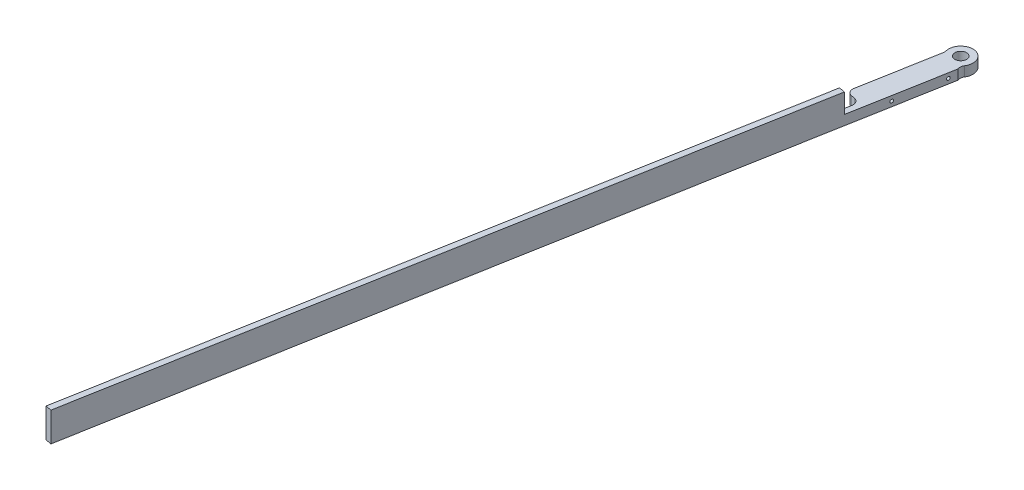
ISO-10303-21;
HEADER;
FILE_DESCRIPTION(('STEP AP214'),'2;1');
FILE_NAME('part.step','',(''),(''),'','','');
FILE_SCHEMA(('AUTOMOTIVE_DESIGN { 1 0 10303 214 1 1 1 1 }'));
ENDSEC;
DATA;
#1=APPLICATION_CONTEXT('core data for automotive mechanical design processes');
#2=APPLICATION_PROTOCOL_DEFINITION('international standard','automotive_design',2000,#1);
#3=PRODUCT_CONTEXT('',#1,'mechanical');
#4=PRODUCT('Part','Part','',(#3));
#5=PRODUCT_RELATED_PRODUCT_CATEGORY('part','',(#4));
#6=PRODUCT_DEFINITION_FORMATION('','',#4);
#7=PRODUCT_DEFINITION_CONTEXT('part definition',#1,'design');
#8=PRODUCT_DEFINITION('design','',#6,#7);
#9=PRODUCT_DEFINITION_SHAPE('','',#8);
#10=(LENGTH_UNIT() NAMED_UNIT(*) SI_UNIT(.MILLI.,.METRE.));
#11=(NAMED_UNIT(*) PLANE_ANGLE_UNIT() SI_UNIT($,.RADIAN.));
#12=(NAMED_UNIT(*) SI_UNIT($,.STERADIAN.) SOLID_ANGLE_UNIT());
#13=UNCERTAINTY_MEASURE_WITH_UNIT(LENGTH_MEASURE(1.E-05),#10,'distance_accuracy_value','');
#14=(GEOMETRIC_REPRESENTATION_CONTEXT(3) GLOBAL_UNCERTAINTY_ASSIGNED_CONTEXT((#13)) GLOBAL_UNIT_ASSIGNED_CONTEXT((#10,
#11,#12)) REPRESENTATION_CONTEXT('',''));
#15=CARTESIAN_POINT('',(0.,0.,0.));
#16=DIRECTION('',(0.,0.,1.));
#17=DIRECTION('',(1.,0.,0.));
#18=AXIS2_PLACEMENT_3D('',#15,#16,#17);
#19=CARTESIAN_POINT('',(-49.5390464281149,13.3887843778313,304.115242751326));
#20=DIRECTION('',(-0.984133598231858,0.,-0.177429030407133));
#21=DIRECTION('',(-0.177429030407133,0.,0.984133598231858));
#22=AXIS2_PLACEMENT_3D('',#19,#20,#21);
#23=PLANE('',#22);
#24=CARTESIAN_POINT('',(-26.4422223948663,9.57878437783127,176.005651601494));
#25=DIRECTION('',(0.984133598231858,0.,0.177429030407133));
#26=DIRECTION('',(0.177429030407133,0.,-0.984133598231858));
#27=AXIS2_PLACEMENT_3D('',#24,#25,#26);
#28=CIRCLE('',#27,0.634999999999989);
#29=CARTESIAN_POINT('',(-26.3295549605578,9.57878437783127,175.380726766617));
#30=VERTEX_POINT('',#29);
#31=EDGE_CURVE('E197',#30,#30,#28,.T.);
#32=ORIENTED_EDGE('',*,*,#31,.T.);
#33=EDGE_LOOP('',(#32));
#34=FACE_BOUND('',#33,.T.);
#35=CARTESIAN_POINT('',(-26.4422223948661,9.57878437783127,176.005651601494));
#36=DIRECTION('',(0.984133598231858,0.,0.177429030407133));
#37=DIRECTION('',(-0.177429030407133,0.,0.984133598231858));
#38=AXIS2_PLACEMENT_3D('',#35,#36,#37);
#39=CIRCLE('',#38,1.27);
#40=CARTESIAN_POINT('',(-26.6675572634832,9.57878437783127,177.255501271248));
#41=VERTEX_POINT('',#40);
#42=EDGE_CURVE('E285',#41,#41,#39,.T.);
#43=ORIENTED_EDGE('',*,*,#42,.F.);
#44=EDGE_LOOP('',(#43));
#45=FACE_BOUND('',#44,.T.);
#46=ADVANCED_FACE('F44',(#34,#45),#23,.T.);
#47=CARTESIAN_POINT('',(-23.0621993656104,9.57878437783127,157.257906555177));
#48=DIRECTION('',(0.984133598231858,0.,0.177429030407133));
#49=DIRECTION('',(0.177429030407133,0.,-0.984133598231858));
#50=AXIS2_PLACEMENT_3D('',#47,#48,#49);
#51=CIRCLE('',#50,0.634999999999989);
#52=CARTESIAN_POINT('',(-22.9495319313019,9.57878437783127,156.6329817203));
#53=VERTEX_POINT('',#52);
#54=EDGE_CURVE('E160',#53,#53,#51,.T.);
#55=ORIENTED_EDGE('',*,*,#54,.T.);
#56=EDGE_LOOP('',(#55));
#57=FACE_BOUND('',#56,.T.);
#58=CARTESIAN_POINT('',(-23.0621993656102,9.57878437783127,157.257906555177));
#59=DIRECTION('',(0.984133598231858,0.,0.177429030407133));
#60=DIRECTION('',(-0.177429030407133,0.,0.984133598231858));
#61=AXIS2_PLACEMENT_3D('',#58,#59,#60);
#62=CIRCLE('',#61,1.27);
#63=CARTESIAN_POINT('',(-23.2875342342273,9.57878437783127,158.507756224931));
#64=VERTEX_POINT('',#63);
#65=EDGE_CURVE('E278',#64,#64,#62,.T.);
#66=ORIENTED_EDGE('',*,*,#65,.F.);
#67=EDGE_LOOP('',(#66));
#68=FACE_BOUND('',#67,.T.);
#69=ADVANCED_FACE('F325',(#57,#68),#23,.T.);
#70=CARTESIAN_POINT('',(-74.2357625313724,19.1037843778313,454.519706000519));
#71=DIRECTION('',(0.,-1.,0.));
#72=DIRECTION('',(-0.984133598231858,0.,-0.177429030407133));
#73=AXIS2_PLACEMENT_3D('',#70,#71,#72);
#74=PLANE('',#73);
#75=DIRECTION('',(-0.177429030407133,0.,0.984133598231858));
#76=VECTOR('',#75,1.);
#77=CARTESIAN_POINT('',(-74.2357625313724,19.1037843778313,454.519706000519));
#78=LINE('',#77,#76);
#79=CARTESIAN_POINT('',(-26.91544012179,19.1037843778313,192.051275352082));
#80=VERTEX_POINT('',#79);
#81=CARTESIAN_POINT('',(-74.2357625313724,19.1037843778313,454.519706000519));
#82=VERTEX_POINT('',#81);
#83=EDGE_CURVE('E208',#80,#82,#78,.T.);
#84=ORIENTED_EDGE('',*,*,#83,.F.);
#85=DIRECTION('',(0.984133598231858,0.,0.177429030407133));
#86=VECTOR('',#85,1.);
#87=CARTESIAN_POINT('',(-29.2589082525796,19.1037843778313,191.628772473425));
#88=LINE('',#87,#86);
#89=CARTESIAN_POINT('',(-29.2589082525796,19.1037843778313,191.628772473425));
#90=VERTEX_POINT('',#89);
#91=EDGE_CURVE('E179',#90,#80,#88,.T.);
#92=ORIENTED_EDGE('',*,*,#91,.F.);
#93=DIRECTION('',(-0.177429030407133,0.,0.984133598231858));
#94=VECTOR('',#93,1.);
#95=CARTESIAN_POINT('',(-76.579230662162,19.1037843778313,454.097203121862));
#96=LINE('',#95,#94);
#97=CARTESIAN_POINT('',(-76.579230662162,19.1037843778313,454.097203121862));
#98=VERTEX_POINT('',#97);
#99=EDGE_CURVE('E191',#90,#98,#96,.T.);
#100=ORIENTED_EDGE('',*,*,#99,.T.);
#101=DIRECTION('',(-0.984133598231858,0.,-0.177429030407133));
#102=VECTOR('',#101,1.);
#103=CARTESIAN_POINT('',(-74.2357625313724,19.1037843778313,454.519706000519));
#104=LINE('',#103,#102);
#105=EDGE_CURVE('E230',#82,#98,#104,.T.);
#106=ORIENTED_EDGE('',*,*,#105,.F.);
#107=EDGE_LOOP('',(#84,#92,#100,#106));
#108=FACE_BOUND('',#107,.T.);
#109=ADVANCED_FACE('F331',(#108),#74,.F.);
#110=CARTESIAN_POINT('',(-74.2357625313724,7.67378437783127,454.519706000519));
#111=DIRECTION('',(0.177429030407133,0.,-0.984133598231858));
#112=DIRECTION('',(-0.984133598231858,0.,-0.177429030407133));
#113=AXIS2_PLACEMENT_3D('',#110,#111,#112);
#114=PLANE('',#113);
#115=DIRECTION('',(0.,-1.,0.));
#116=VECTOR('',#115,1.);
#117=CARTESIAN_POINT('',(-76.579230662162,7.67378437783127,454.097203121862));
#118=LINE('',#117,#116);
#119=CARTESIAN_POINT('',(-76.579230662162,7.67378437783127,454.097203121862));
#120=VERTEX_POINT('',#119);
#121=EDGE_CURVE('E222',#98,#120,#118,.T.);
#122=ORIENTED_EDGE('',*,*,#121,.T.);
#123=DIRECTION('',(-0.984133598231858,0.,-0.177429030407133));
#124=VECTOR('',#123,1.);
#125=CARTESIAN_POINT('',(-74.2357625313724,7.67378437783127,454.519706000519));
#126=LINE('',#125,#124);
#127=CARTESIAN_POINT('',(-74.2357625313724,7.67378437783127,454.519706000519));
#128=VERTEX_POINT('',#127);
#129=EDGE_CURVE('E219',#128,#120,#126,.T.);
#130=ORIENTED_EDGE('',*,*,#129,.F.);
#131=DIRECTION('',(0.,-1.,0.));
#132=VECTOR('',#131,1.);
#133=CARTESIAN_POINT('',(-74.2357625313724,7.67378437783127,454.519706000519));
#134=LINE('',#133,#132);
#135=EDGE_CURVE('E212',#82,#128,#134,.T.);
#136=ORIENTED_EDGE('',*,*,#135,.F.);
#137=ORIENTED_EDGE('',*,*,#105,.T.);
#138=EDGE_LOOP('',(#122,#130,#136,#137));
#139=FACE_BOUND('',#138,.T.);
#140=ADVANCED_FACE('F348',(#139),#114,.F.);
#141=CARTESIAN_POINT('',(-74.2357625313724,7.67378437783127,454.519706000519));
#142=DIRECTION('',(0.,1.,0.));
#143=DIRECTION('',(0.984133598231858,0.,0.177429030407133));
#144=AXIS2_PLACEMENT_3D('',#141,#142,#143);
#145=PLANE('',#144);
#146=CARTESIAN_POINT('',(-23.9630801063453,7.67378437783126,149.601453593715));
#147=DIRECTION('',(0.,1.,0.));
#148=DIRECTION('',(0.,0.,1.));
#149=AXIS2_PLACEMENT_3D('',#146,#147,#148);
#150=CIRCLE('',#149,2.286);
#151=CARTESIAN_POINT('',(-23.9630801063453,7.67378437783126,151.887453593715));
#152=VERTEX_POINT('',#151);
#153=EDGE_CURVE('E286',#152,#152,#150,.T.);
#154=ORIENTED_EDGE('',*,*,#153,.T.);
#155=EDGE_LOOP('',(#154));
#156=FACE_BOUND('',#155,.T.);
#157=DIRECTION('',(-0.984133598231858,0.,-0.177429030407133));
#158=VECTOR('',#157,1.);
#159=CARTESIAN_POINT('',(-30.2764599416353,7.67378437783127,184.619450367138));
#160=LINE('',#159,#158);
#161=CARTESIAN_POINT('',(-30.5667163387765,7.67378437783127,184.567120163996));
#162=VERTEX_POINT('',#161);
#163=CARTESIAN_POINT('',(-31.8165660085308,7.67378437783127,184.341785295379));
#164=VERTEX_POINT('',#163);
#165=EDGE_CURVE('E153',#162,#164,#160,.T.);
#166=ORIENTED_EDGE('',*,*,#165,.T.);
#167=CARTESIAN_POINT('',(-31.3658962712967,7.67378437783127,181.84208595587));
#168=DIRECTION('',(0.,1.,0.));
#169=DIRECTION('',(0.,0.,1.));
#170=AXIS2_PLACEMENT_3D('',#167,#168,#169);
#171=CIRCLE('',#170,2.54);
#172=CARTESIAN_POINT('',(-33.8655956108057,7.67378437783127,181.391416218636));
#173=VERTEX_POINT('',#172);
#174=EDGE_CURVE('E137',#164,#173,#171,.F.);
#175=ORIENTED_EDGE('',*,*,#174,.T.);
#176=DIRECTION('',(0.177429030407133,0.,-0.984133598231858));
#177=VECTOR('',#176,1.);
#178=CARTESIAN_POINT('',(-28.0028855127497,7.67378437783127,148.873118784722));
#179=LINE('',#178,#177);
#180=CARTESIAN_POINT('',(-28.4313281995852,7.67378437783127,151.249532847652));
#181=VERTEX_POINT('',#180);
#182=EDGE_CURVE('E131',#173,#181,#179,.T.);
#183=ORIENTED_EDGE('',*,*,#182,.T.);
#184=CARTESIAN_POINT('',(-23.9630801063453,7.67378437783127,149.601453593715));
#185=DIRECTION('',(0.,-1.,0.));
#186=DIRECTION('',(-0.177429030407133,0.,0.984133598231858));
#187=AXIS2_PLACEMENT_3D('',#184,#185,#186);
#188=CIRCLE('',#187,4.7625);
#189=CARTESIAN_POINT('',(-19.9579423799372,7.67378437783127,152.178327289204));
#190=VERTEX_POINT('',#189);
#191=EDGE_CURVE('E134',#181,#190,#188,.T.);
#192=ORIENTED_EDGE('',*,*,#191,.T.);
#193=CARTESIAN_POINT('',(-17.8218689258528,7.67378437783127,153.552659926798));
#194=DIRECTION('',(0.,1.,0.));
#195=DIRECTION('',(0.,0.,1.));
#196=AXIS2_PLACEMENT_3D('',#193,#194,#195);
#197=CIRCLE('',#196,2.54);
#198=CARTESIAN_POINT('',(-20.1553940632782,7.67378437783127,154.555785259448));
#199=VERTEX_POINT('',#198);
#200=EDGE_CURVE('E255',#190,#199,#197,.T.);
#201=ORIENTED_EDGE('',*,*,#200,.T.);
#202=DIRECTION('',(0.177429030407133,0.,-0.984133598231858));
#203=VECTOR('',#202,1.);
#204=CARTESIAN_POINT('',(-74.2357625313724,7.67378437783127,454.519706000519));
#205=LINE('',#204,#203);
#206=EDGE_CURVE('E215',#128,#199,#205,.T.);
#207=ORIENTED_EDGE('',*,*,#206,.F.);
#208=ORIENTED_EDGE('',*,*,#129,.T.);
#209=DIRECTION('',(0.177429030407133,0.,-0.984133598231858));
#210=VECTOR('',#209,1.);
#211=CARTESIAN_POINT('',(-76.579230662162,7.67378437783127,454.097203121862));
#212=LINE('',#211,#210);
#213=CARTESIAN_POINT('',(-28.5176867365017,7.67378437783127,187.517489240739));
#214=VERTEX_POINT('',#213);
#215=EDGE_CURVE('E209',#120,#214,#212,.T.);
#216=ORIENTED_EDGE('',*,*,#215,.T.);
#217=CARTESIAN_POINT('',(-31.0173860760106,7.67378437783127,187.066819503505));
#218=DIRECTION('',(0.,1.,0.));
#219=DIRECTION('',(0.,0.,1.));
#220=AXIS2_PLACEMENT_3D('',#217,#218,#219);
#221=CIRCLE('',#220,2.54);
#222=EDGE_CURVE('E11',#214,#162,#221,.T.);
#223=ORIENTED_EDGE('',*,*,#222,.T.);
#224=EDGE_LOOP('',(#166,#175,#183,#192,#201,#207,#208,#216,#223));
#225=FACE_BOUND('',#224,.T.);
#226=ADVANCED_FACE('F133',(#156,#225),#145,.F.);
#227=CARTESIAN_POINT('',(-47.1955782973253,13.3887843778313,304.537745629983));
#228=DIRECTION('',(-0.984133598231858,0.,-0.177429030407133));
#229=DIRECTION('',(-0.177429030407133,0.,0.984133598231858));
#230=AXIS2_PLACEMENT_3D('',#227,#228,#229);
#231=PLANE('',#230);
#232=CARTESIAN_POINT('',(-24.0987542640767,9.57878437783127,176.428154480151));
#233=DIRECTION('',(0.984133598231858,0.,0.177429030407133));
#234=DIRECTION('',(0.177429030407133,0.,-0.984133598231858));
#235=AXIS2_PLACEMENT_3D('',#232,#233,#234);
#236=CIRCLE('',#235,0.634999999999989);
#237=CARTESIAN_POINT('',(-23.9860868297682,9.57878437783127,175.803229645274));
#238=VERTEX_POINT('',#237);
#239=EDGE_CURVE('E184',#238,#238,#236,.T.);
#240=ORIENTED_EDGE('',*,*,#239,.F.);
#241=EDGE_LOOP('',(#240));
#242=FACE_BOUND('',#241,.T.);
#243=CARTESIAN_POINT('',(-20.7187312348208,9.57878437783127,157.680409433834));
#244=DIRECTION('',(0.984133598231858,0.,0.177429030407133));
#245=DIRECTION('',(0.177429030407133,0.,-0.984133598231858));
#246=AXIS2_PLACEMENT_3D('',#243,#244,#245);
#247=CIRCLE('',#246,0.634999999999989);
#248=CARTESIAN_POINT('',(-20.6060638005123,9.57878437783127,157.055484598957));
#249=VERTEX_POINT('',#248);
#250=EDGE_CURVE('E165',#249,#249,#247,.T.);
#251=ORIENTED_EDGE('',*,*,#250,.F.);
#252=EDGE_LOOP('',(#251));
#253=FACE_BOUND('',#252,.T.);
#254=DIRECTION('',(0.,1.,0.));
#255=VECTOR('',#254,1.);
#256=CARTESIAN_POINT('',(-20.1553940632782,7.67378437783127,154.555785259448));
#257=LINE('',#256,#255);
#258=CARTESIAN_POINT('',(-20.1553940632782,11.4837843778313,154.555785259448));
#259=VERTEX_POINT('',#258);
#260=EDGE_CURVE('E204',#199,#259,#257,.T.);
#261=ORIENTED_EDGE('',*,*,#260,.T.);
#262=DIRECTION('',(0.177429030407133,0.,-0.984133598231858));
#263=VECTOR('',#262,1.);
#264=CARTESIAN_POINT('',(-20.1553940632782,11.4837843778313,154.555785259448));
#265=LINE('',#264,#263);
#266=CARTESIAN_POINT('',(-26.91544012179,11.4837843778313,192.051275352082));
#267=VERTEX_POINT('',#266);
#268=EDGE_CURVE('E176',#267,#259,#265,.T.);
#269=ORIENTED_EDGE('',*,*,#268,.F.);
#270=DIRECTION('',(0.,-1.,0.));
#271=VECTOR('',#270,1.);
#272=CARTESIAN_POINT('',(-26.91544012179,19.1037843778313,192.051275352082));
#273=LINE('',#272,#271);
#274=EDGE_CURVE('E180',#80,#267,#273,.T.);
#275=ORIENTED_EDGE('',*,*,#274,.F.);
#276=ORIENTED_EDGE('',*,*,#83,.T.);
#277=ORIENTED_EDGE('',*,*,#135,.T.);
#278=ORIENTED_EDGE('',*,*,#206,.T.);
#279=EDGE_LOOP('',(#261,#269,#275,#276,#277,#278));
#280=FACE_BOUND('',#279,.T.);
#281=ADVANCED_FACE('F337',(#242,#253,#280),#231,.F.);
#282=DIRECTION('',(0.177429030407133,0.,-0.984133598231858));
#283=VECTOR('',#282,1.);
#284=CARTESIAN_POINT('',(-22.4988621940678,11.4837843778313,154.133282380791));
#285=LINE('',#284,#283);
#286=CARTESIAN_POINT('',(-29.2589082525796,11.4837843778313,191.628772473425));
#287=VERTEX_POINT('',#286);
#288=CARTESIAN_POINT('',(-28.5176867365017,11.4837843778313,187.517489240739));
#289=VERTEX_POINT('',#288);
#290=EDGE_CURVE('E175',#287,#289,#285,.T.);
#291=ORIENTED_EDGE('',*,*,#290,.T.);
#292=DIRECTION('',(0.,1.,0.));
#293=VECTOR('',#292,1.);
#294=CARTESIAN_POINT('',(-28.5176867365017,13.3887843778313,187.517489240739));
#295=LINE('',#294,#293);
#296=EDGE_CURVE('E60',#289,#214,#295,.F.);
#297=ORIENTED_EDGE('',*,*,#296,.T.);
#298=ORIENTED_EDGE('',*,*,#215,.F.);
#299=ORIENTED_EDGE('',*,*,#121,.F.);
#300=ORIENTED_EDGE('',*,*,#99,.F.);
#301=DIRECTION('',(0.,-1.,0.));
#302=VECTOR('',#301,1.);
#303=CARTESIAN_POINT('',(-29.2589082525796,19.1037843778313,191.628772473425));
#304=LINE('',#303,#302);
#305=EDGE_CURVE('E171',#90,#287,#304,.T.);
#306=ORIENTED_EDGE('',*,*,#305,.T.);
#307=EDGE_LOOP('',(#291,#297,#298,#299,#300,#306));
#308=FACE_BOUND('',#307,.T.);
#309=ADVANCED_FACE('F264',(#308),#23,.T.);
#310=CARTESIAN_POINT('',(-23.0621993656104,9.57878437783127,157.257906555177));
#311=DIRECTION('',(0.984133598231858,0.,0.177429030407133));
#312=DIRECTION('',(0.177429030407133,0.,-0.984133598231858));
#313=AXIS2_PLACEMENT_3D('',#310,#311,#312);
#314=CYLINDRICAL_SURFACE('',#313,0.634999999999989);
#315=ORIENTED_EDGE('',*,*,#54,.F.);
#316=EDGE_LOOP('',(#315));
#317=FACE_BOUND('',#316,.T.);
#318=ORIENTED_EDGE('',*,*,#250,.T.);
#319=EDGE_LOOP('',(#318));
#320=FACE_BOUND('',#319,.T.);
#321=ADVANCED_FACE('F320',(#317,#320),#314,.F.);
#322=CARTESIAN_POINT('',(-26.4422223948663,9.57878437783127,176.005651601494));
#323=DIRECTION('',(0.984133598231858,0.,0.177429030407133));
#324=DIRECTION('',(0.177429030407133,0.,-0.984133598231858));
#325=AXIS2_PLACEMENT_3D('',#322,#323,#324);
#326=CYLINDRICAL_SURFACE('',#325,0.634999999999989);
#327=ORIENTED_EDGE('',*,*,#31,.F.);
#328=EDGE_LOOP('',(#327));
#329=FACE_BOUND('',#328,.T.);
#330=ORIENTED_EDGE('',*,*,#239,.T.);
#331=EDGE_LOOP('',(#330));
#332=FACE_BOUND('',#331,.T.);
#333=ADVANCED_FACE('F311',(#329,#332),#326,.F.);
#334=CARTESIAN_POINT('',(-22.4988621940678,11.4837843778313,154.133282380791));
#335=DIRECTION('',(0.,-1.,0.));
#336=DIRECTION('',(0.177429030407133,0.,-0.984133598231858));
#337=AXIS2_PLACEMENT_3D('',#334,#335,#336);
#338=PLANE('',#337);
#339=CARTESIAN_POINT('',(-23.9630801063453,11.4837843778313,149.601453593715));
#340=DIRECTION('',(0.,1.,0.));
#341=DIRECTION('',(0.,0.,1.));
#342=AXIS2_PLACEMENT_3D('',#339,#340,#341);
#343=CIRCLE('',#342,2.286);
#344=CARTESIAN_POINT('',(-23.9630801063453,11.4837843778313,151.887453593715));
#345=VERTEX_POINT('',#344);
#346=EDGE_CURVE('E293',#345,#345,#343,.T.);
#347=ORIENTED_EDGE('',*,*,#346,.F.);
#348=EDGE_LOOP('',(#347));
#349=FACE_BOUND('',#348,.T.);
#350=DIRECTION('',(0.177429030407133,0.,-0.984133598231858));
#351=VECTOR('',#350,1.);
#352=CARTESIAN_POINT('',(-28.0028855127497,11.4837843778313,148.873118784722));
#353=LINE('',#352,#351);
#354=CARTESIAN_POINT('',(-33.8655956108057,11.4837843778313,181.391416218636));
#355=VERTEX_POINT('',#354);
#356=CARTESIAN_POINT('',(-28.4313281995852,11.4837843778313,151.249532847652));
#357=VERTEX_POINT('',#356);
#358=EDGE_CURVE('E157',#355,#357,#353,.T.);
#359=ORIENTED_EDGE('',*,*,#358,.F.);
#360=CARTESIAN_POINT('',(-31.3658962712967,11.4837843778313,181.84208595587));
#361=DIRECTION('',(0.,-1.,0.));
#362=DIRECTION('',(0.,0.,-1.));
#363=AXIS2_PLACEMENT_3D('',#360,#361,#362);
#364=CIRCLE('',#363,2.54);
#365=CARTESIAN_POINT('',(-31.8165660085308,11.4837843778313,184.341785295379));
#366=VERTEX_POINT('',#365);
#367=EDGE_CURVE('E239',#355,#366,#364,.F.);
#368=ORIENTED_EDGE('',*,*,#367,.T.);
#369=DIRECTION('',(-0.984133598231858,0.,-0.177429030407133));
#370=VECTOR('',#369,1.);
#371=CARTESIAN_POINT('',(-30.2764599416353,11.4837843778313,184.619450367138));
#372=LINE('',#371,#370);
#373=CARTESIAN_POINT('',(-30.5667163387765,11.4837843778313,184.567120163996));
#374=VERTEX_POINT('',#373);
#375=EDGE_CURVE('E143',#374,#366,#372,.T.);
#376=ORIENTED_EDGE('',*,*,#375,.F.);
#377=CARTESIAN_POINT('',(-31.0173860760106,11.4837843778313,187.066819503505));
#378=DIRECTION('',(0.,-1.,0.));
#379=DIRECTION('',(0.,0.,-1.));
#380=AXIS2_PLACEMENT_3D('',#377,#378,#379);
#381=CIRCLE('',#380,2.54);
#382=EDGE_CURVE('E53',#374,#289,#381,.T.);
#383=ORIENTED_EDGE('',*,*,#382,.T.);
#384=ORIENTED_EDGE('',*,*,#290,.F.);
#385=DIRECTION('',(0.984133598231858,0.,0.177429030407133));
#386=VECTOR('',#385,1.);
#387=CARTESIAN_POINT('',(-29.2589082525796,11.4837843778313,191.628772473425));
#388=LINE('',#387,#386);
#389=EDGE_CURVE('E188',#287,#267,#388,.T.);
#390=ORIENTED_EDGE('',*,*,#389,.T.);
#391=ORIENTED_EDGE('',*,*,#268,.T.);
#392=CARTESIAN_POINT('',(-17.8218689258528,11.4837843778313,153.552659926798));
#393=DIRECTION('',(0.,-1.,0.));
#394=DIRECTION('',(0.,0.,-1.));
#395=AXIS2_PLACEMENT_3D('',#392,#393,#394);
#396=CIRCLE('',#395,2.54);
#397=CARTESIAN_POINT('',(-19.9579423799372,11.4837843778313,152.178327289204));
#398=VERTEX_POINT('',#397);
#399=EDGE_CURVE('E252',#259,#398,#396,.T.);
#400=ORIENTED_EDGE('',*,*,#399,.T.);
#401=CARTESIAN_POINT('',(-23.9630801063453,11.4837843778313,149.601453593715));
#402=DIRECTION('',(0.,-1.,0.));
#403=DIRECTION('',(-0.177429030407133,0.,0.984133598231858));
#404=AXIS2_PLACEMENT_3D('',#401,#402,#403);
#405=CIRCLE('',#404,4.7625);
#406=EDGE_CURVE('E269',#357,#398,#405,.T.);
#407=ORIENTED_EDGE('',*,*,#406,.F.);
#408=EDGE_LOOP('',(#359,#368,#376,#383,#384,#390,#391,#400,#407));
#409=FACE_BOUND('',#408,.T.);
#410=ADVANCED_FACE('F260',(#349,#409),#338,.F.);
#411=CARTESIAN_POINT('',(-29.2589082525796,19.1037843778313,191.628772473425));
#412=DIRECTION('',(-0.177429030407133,0.,0.984133598231858));
#413=DIRECTION('',(0.984133598231858,0.,0.177429030407133));
#414=AXIS2_PLACEMENT_3D('',#411,#412,#413);
#415=PLANE('',#414);
#416=ORIENTED_EDGE('',*,*,#274,.T.);
#417=ORIENTED_EDGE('',*,*,#389,.F.);
#418=ORIENTED_EDGE('',*,*,#305,.F.);
#419=ORIENTED_EDGE('',*,*,#91,.T.);
#420=EDGE_LOOP('',(#416,#417,#418,#419));
#421=FACE_BOUND('',#420,.T.);
#422=ADVANCED_FACE('F310',(#421),#415,.F.);
#423=CARTESIAN_POINT('',(-26.1868235399964,9.57878437783127,156.694569383634));
#424=DIRECTION('',(0.984133598231858,0.,0.177429030407133));
#425=DIRECTION('',(-0.177429030407133,0.,0.984133598231858));
#426=AXIS2_PLACEMENT_3D('',#423,#424,#425);
#427=PLANE('',#426);
#428=CARTESIAN_POINT('',(-26.1868235399964,9.57878437783127,156.694569383634));
#429=DIRECTION('',(0.984133598231858,0.,0.177429030407133));
#430=DIRECTION('',(-0.177429030407133,0.,0.984133598231858));
#431=AXIS2_PLACEMENT_3D('',#428,#429,#430);
#432=CIRCLE('',#431,1.27);
#433=CARTESIAN_POINT('',(-26.4121584086135,9.57878437783127,157.944419053389));
#434=VERTEX_POINT('',#433);
#435=EDGE_CURVE('E273',#434,#434,#432,.T.);
#436=ORIENTED_EDGE('',*,*,#435,.T.);
#437=EDGE_LOOP('',(#436));
#438=FACE_BOUND('',#437,.T.);
#439=ADVANCED_FACE('F317',(#438),#427,.T.);
#440=CARTESIAN_POINT('',(-26.1868235399964,9.57878437783127,156.694569383634));
#441=DIRECTION('',(0.984133598231858,0.,0.177429030407133));
#442=DIRECTION('',(-0.177429030407133,0.,0.984133598231858));
#443=AXIS2_PLACEMENT_3D('',#440,#441,#442);
#444=CYLINDRICAL_SURFACE('',#443,1.27);
#445=ORIENTED_EDGE('',*,*,#435,.F.);
#446=EDGE_LOOP('',(#445));
#447=FACE_BOUND('',#446,.T.);
#448=ORIENTED_EDGE('',*,*,#65,.T.);
#449=EDGE_LOOP('',(#448));
#450=FACE_BOUND('',#449,.T.);
#451=ADVANCED_FACE('F458',(#447,#450),#444,.F.);
#452=CARTESIAN_POINT('',(-29.5668465692523,9.57878437783127,175.442314429951));
#453=DIRECTION('',(0.984133598231858,0.,0.177429030407133));
#454=DIRECTION('',(-0.177429030407133,0.,0.984133598231858));
#455=AXIS2_PLACEMENT_3D('',#452,#453,#454);
#456=PLANE('',#455);
#457=CARTESIAN_POINT('',(-29.5668465692523,9.57878437783127,175.442314429951));
#458=DIRECTION('',(0.984133598231858,0.,0.177429030407133));
#459=DIRECTION('',(-0.177429030407133,0.,0.984133598231858));
#460=AXIS2_PLACEMENT_3D('',#457,#458,#459);
#461=CIRCLE('',#460,1.27);
#462=CARTESIAN_POINT('',(-29.7921814378693,9.57878437783127,176.692164099706));
#463=VERTEX_POINT('',#462);
#464=EDGE_CURVE('E281',#463,#463,#461,.T.);
#465=ORIENTED_EDGE('',*,*,#464,.T.);
#466=EDGE_LOOP('',(#465));
#467=FACE_BOUND('',#466,.T.);
#468=ADVANCED_FACE('F449',(#467),#456,.T.);
#469=CARTESIAN_POINT('',(-29.5668465692523,9.57878437783127,175.442314429951));
#470=DIRECTION('',(0.984133598231858,0.,0.177429030407133));
#471=DIRECTION('',(-0.177429030407133,0.,0.984133598231858));
#472=AXIS2_PLACEMENT_3D('',#469,#470,#471);
#473=CYLINDRICAL_SURFACE('',#472,1.27);
#474=ORIENTED_EDGE('',*,*,#464,.F.);
#475=EDGE_LOOP('',(#474));
#476=FACE_BOUND('',#475,.T.);
#477=ORIENTED_EDGE('',*,*,#42,.T.);
#478=EDGE_LOOP('',(#477));
#479=FACE_BOUND('',#478,.T.);
#480=ADVANCED_FACE('F416',(#476,#479),#473,.F.);
#481=CARTESIAN_POINT('',(-28.0028855127497,7.67378437783127,148.873118784722));
#482=DIRECTION('',(0.984133598231858,0.,0.177429030407133));
#483=DIRECTION('',(-0.177429030407133,0.,0.984133598231858));
#484=AXIS2_PLACEMENT_3D('',#481,#482,#483);
#485=PLANE('',#484);
#486=ORIENTED_EDGE('',*,*,#182,.F.);
#487=DIRECTION('',(0.,1.,0.));
#488=VECTOR('',#487,1.);
#489=CARTESIAN_POINT('',(-33.8655956108057,7.67378437783127,181.391416218636));
#490=LINE('',#489,#488);
#491=EDGE_CURVE('E236',#173,#355,#490,.T.);
#492=ORIENTED_EDGE('',*,*,#491,.T.);
#493=ORIENTED_EDGE('',*,*,#358,.T.);
#494=DIRECTION('',(0.,1.,0.));
#495=VECTOR('',#494,1.);
#496=CARTESIAN_POINT('',(-28.4313281995852,7.67378437783127,151.249532847652));
#497=LINE('',#496,#495);
#498=EDGE_CURVE('E149',#181,#357,#497,.T.);
#499=ORIENTED_EDGE('',*,*,#498,.F.);
#500=EDGE_LOOP('',(#486,#492,#493,#499));
#501=FACE_BOUND('',#500,.T.);
#502=ADVANCED_FACE('F155',(#501),#485,.F.);
#503=CARTESIAN_POINT('',(-23.9630801063453,7.67378437783127,149.601453593715));
#504=DIRECTION('',(0.,1.,0.));
#505=DIRECTION('',(0.177429030407133,0.,-0.984133598231858));
#506=AXIS2_PLACEMENT_3D('',#503,#504,#505);
#507=CYLINDRICAL_SURFACE('',#506,4.7625);
#508=ORIENTED_EDGE('',*,*,#406,.T.);
#509=DIRECTION('',(0.,1.,0.));
#510=VECTOR('',#509,1.);
#511=CARTESIAN_POINT('',(-19.9579423799372,7.67378437783127,152.178327289204));
#512=LINE('',#511,#510);
#513=EDGE_CURVE('E151',#398,#190,#512,.F.);
#514=ORIENTED_EDGE('',*,*,#513,.T.);
#515=ORIENTED_EDGE('',*,*,#191,.F.);
#516=ORIENTED_EDGE('',*,*,#498,.T.);
#517=EDGE_LOOP('',(#508,#514,#515,#516));
#518=FACE_BOUND('',#517,.T.);
#519=ADVANCED_FACE('F148',(#518),#507,.T.);
#520=CARTESIAN_POINT('',(-30.2764599416353,7.67378437783127,184.619450367138));
#521=DIRECTION('',(0.177429030407133,0.,-0.984133598231858));
#522=DIRECTION('',(0.984133598231858,0.,0.177429030407133));
#523=AXIS2_PLACEMENT_3D('',#520,#521,#522);
#524=PLANE('',#523);
#525=ORIENTED_EDGE('',*,*,#375,.T.);
#526=DIRECTION('',(0.,1.,0.));
#527=VECTOR('',#526,1.);
#528=CARTESIAN_POINT('',(-31.8165660085308,7.67378437783127,184.341785295379));
#529=LINE('',#528,#527);
#530=EDGE_CURVE('E68',#366,#164,#529,.F.);
#531=ORIENTED_EDGE('',*,*,#530,.T.);
#532=ORIENTED_EDGE('',*,*,#165,.F.);
#533=DIRECTION('',(0.,1.,0.));
#534=VECTOR('',#533,1.);
#535=CARTESIAN_POINT('',(-30.5667163387765,7.67378437783127,184.567120163996));
#536=LINE('',#535,#534);
#537=EDGE_CURVE('E242',#162,#374,#536,.T.);
#538=ORIENTED_EDGE('',*,*,#537,.T.);
#539=EDGE_LOOP('',(#525,#531,#532,#538));
#540=FACE_BOUND('',#539,.T.);
#541=ADVANCED_FACE('F267',(#540),#524,.F.);
#542=CARTESIAN_POINT('',(-23.9630801063453,7.67378437783126,149.601453593715));
#543=DIRECTION('',(0.,1.,0.));
#544=DIRECTION('',(0.,0.,1.));
#545=AXIS2_PLACEMENT_3D('',#542,#543,#544);
#546=CYLINDRICAL_SURFACE('',#545,2.286);
#547=ORIENTED_EDGE('',*,*,#153,.F.);
#548=EDGE_LOOP('',(#547));
#549=FACE_BOUND('',#548,.T.);
#550=ORIENTED_EDGE('',*,*,#346,.T.);
#551=EDGE_LOOP('',(#550));
#552=FACE_BOUND('',#551,.T.);
#553=ADVANCED_FACE('F302',(#549,#552),#546,.F.);
#554=CARTESIAN_POINT('',(-17.8218689258528,7.67378437783127,153.552659926798));
#555=DIRECTION('',(0.,-1.,0.));
#556=DIRECTION('',(0.,0.,-1.));
#557=AXIS2_PLACEMENT_3D('',#554,#555,#556);
#558=CYLINDRICAL_SURFACE('',#557,2.54);
#559=ORIENTED_EDGE('',*,*,#200,.F.);
#560=ORIENTED_EDGE('',*,*,#513,.F.);
#561=ORIENTED_EDGE('',*,*,#399,.F.);
#562=ORIENTED_EDGE('',*,*,#260,.F.);
#563=EDGE_LOOP('',(#559,#560,#561,#562));
#564=FACE_BOUND('',#563,.T.);
#565=ADVANCED_FACE('F305',(#564),#558,.F.);
#566=CARTESIAN_POINT('',(-31.3658962712967,7.67378437783127,181.84208595587));
#567=DIRECTION('',(0.,1.,0.));
#568=DIRECTION('',(0.,0.,1.));
#569=AXIS2_PLACEMENT_3D('',#566,#567,#568);
#570=CYLINDRICAL_SURFACE('',#569,2.54);
#571=ORIENTED_EDGE('',*,*,#174,.F.);
#572=ORIENTED_EDGE('',*,*,#530,.F.);
#573=ORIENTED_EDGE('',*,*,#367,.F.);
#574=ORIENTED_EDGE('',*,*,#491,.F.);
#575=EDGE_LOOP('',(#571,#572,#573,#574));
#576=FACE_BOUND('',#575,.T.);
#577=ADVANCED_FACE('F271',(#576),#570,.T.);
#578=CARTESIAN_POINT('',(-31.0173860760106,7.67378437783127,187.066819503505));
#579=DIRECTION('',(0.,1.,0.));
#580=DIRECTION('',(0.,0.,1.));
#581=AXIS2_PLACEMENT_3D('',#578,#579,#580);
#582=CYLINDRICAL_SURFACE('',#581,2.54);
#583=ORIENTED_EDGE('',*,*,#222,.F.);
#584=ORIENTED_EDGE('',*,*,#296,.F.);
#585=ORIENTED_EDGE('',*,*,#382,.F.);
#586=ORIENTED_EDGE('',*,*,#537,.F.);
#587=EDGE_LOOP('',(#583,#584,#585,#586));
#588=FACE_BOUND('',#587,.T.);
#589=ADVANCED_FACE('F46',(#588),#582,.F.);
#590=CLOSED_SHELL('',(#46,#69,#109,#140,#226,#281,#309,#321,#333,#410,#422,#439,#451,#468,#480,
#502,#519,#541,#553,#565,#577,#589));
#591=MANIFOLD_SOLID_BREP('B2',#590);
#592=ADVANCED_BREP_SHAPE_REPRESENTATION('',(#18,#591),#14);
#593=SHAPE_DEFINITION_REPRESENTATION(#9,#592);
ENDSEC;
END-ISO-10303-21;
